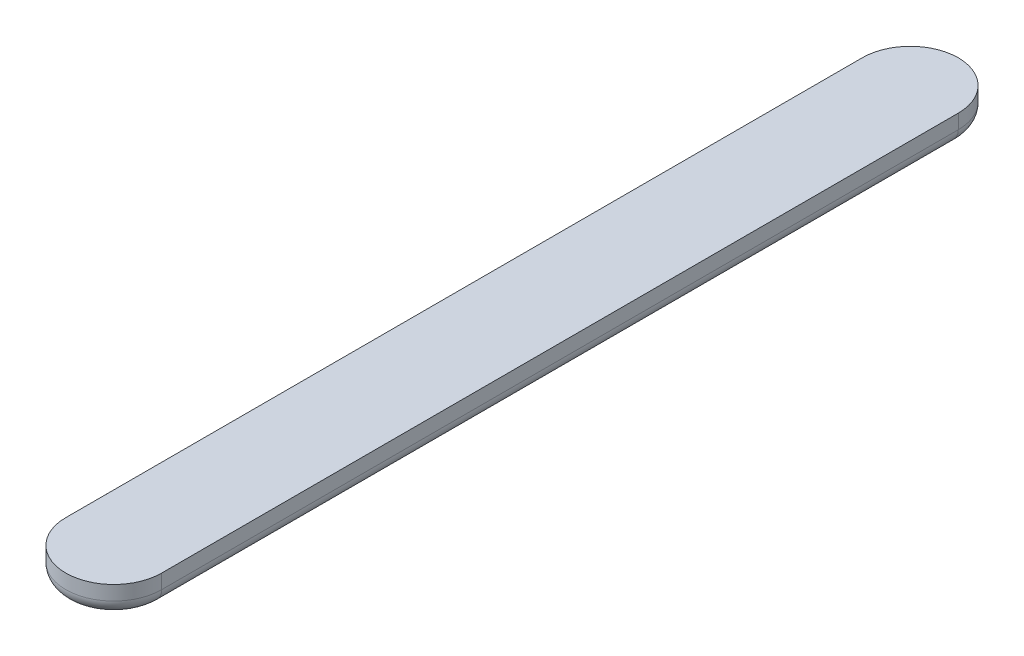
ISO-10303-21;
HEADER;
FILE_DESCRIPTION(('STEP AP214'),'2;1');
FILE_NAME('part.step','',(''),(''),'','','');
FILE_SCHEMA(('AUTOMOTIVE_DESIGN { 1 0 10303 214 1 1 1 1 }'));
ENDSEC;
DATA;
#1=APPLICATION_CONTEXT('core data for automotive mechanical design processes');
#2=APPLICATION_PROTOCOL_DEFINITION('international standard','automotive_design',2000,#1);
#3=PRODUCT_CONTEXT('',#1,'mechanical');
#4=PRODUCT('Part','Part','',(#3));
#5=PRODUCT_RELATED_PRODUCT_CATEGORY('part','',(#4));
#6=PRODUCT_DEFINITION_FORMATION('','',#4);
#7=PRODUCT_DEFINITION_CONTEXT('part definition',#1,'design');
#8=PRODUCT_DEFINITION('design','',#6,#7);
#9=PRODUCT_DEFINITION_SHAPE('','',#8);
#10=(LENGTH_UNIT() NAMED_UNIT(*) SI_UNIT(.MILLI.,.METRE.));
#11=(NAMED_UNIT(*) PLANE_ANGLE_UNIT() SI_UNIT($,.RADIAN.));
#12=(NAMED_UNIT(*) SI_UNIT($,.STERADIAN.) SOLID_ANGLE_UNIT());
#13=UNCERTAINTY_MEASURE_WITH_UNIT(LENGTH_MEASURE(1.E-05),#10,'distance_accuracy_value','');
#14=(GEOMETRIC_REPRESENTATION_CONTEXT(3) GLOBAL_UNCERTAINTY_ASSIGNED_CONTEXT((#13)) GLOBAL_UNIT_ASSIGNED_CONTEXT((#10,
#11,#12)) REPRESENTATION_CONTEXT('',''));
#15=CARTESIAN_POINT('',(0.,0.,0.));
#16=DIRECTION('',(0.,0.,1.));
#17=DIRECTION('',(1.,0.,0.));
#18=AXIS2_PLACEMENT_3D('',#15,#16,#17);
#19=CARTESIAN_POINT('',(0.,-221.2577750009,-17.9620750209408));
#20=DIRECTION('',(0.,1.,0.));
#21=DIRECTION('',(-1.,0.,0.));
#22=AXIS2_PLACEMENT_3D('',#19,#20,#21);
#23=CYLINDRICAL_SURFACE('',#22,10.);
#24=DIRECTION('',(0.,1.,0.));
#25=VECTOR('',#24,1.);
#26=CARTESIAN_POINT('',(-10.,-221.2577750009,-17.9620750209408));
#27=LINE('',#26,#25);
#28=CARTESIAN_POINT('',(-9.99999999999998,-31.1458256229943,-17.9620750209408));
#29=VERTEX_POINT('',#28);
#30=CARTESIAN_POINT('',(-9.99999999999998,-28.1458256229943,-17.9620750209408));
#31=VERTEX_POINT('',#30);
#32=EDGE_CURVE('E11',#29,#31,#27,.T.);
#33=ORIENTED_EDGE('',*,*,#32,.F.);
#34=CARTESIAN_POINT('',(0.,-31.1458256229943,-17.9620750209408));
#35=DIRECTION('',(0.,1.,0.));
#36=DIRECTION('',(1.,0.,0.));
#37=AXIS2_PLACEMENT_3D('',#34,#35,#36);
#38=CIRCLE('',#37,10.);
#39=CARTESIAN_POINT('',(10.,-31.1458256229943,-17.9620750209408));
#40=VERTEX_POINT('',#39);
#41=EDGE_CURVE('E94',#40,#29,#38,.F.);
#42=ORIENTED_EDGE('',*,*,#41,.F.);
#43=DIRECTION('',(0.,1.,0.));
#44=VECTOR('',#43,1.);
#45=CARTESIAN_POINT('',(9.99999999999999,-221.2577750009,-17.9620750209408));
#46=LINE('',#45,#44);
#47=CARTESIAN_POINT('',(10.,-28.1458256229943,-17.9620750209408));
#48=VERTEX_POINT('',#47);
#49=EDGE_CURVE('E37',#40,#48,#46,.T.);
#50=ORIENTED_EDGE('',*,*,#49,.T.);
#51=CARTESIAN_POINT('',(0.,-28.1458256229943,-17.9620750209408));
#52=DIRECTION('',(0.,1.,0.));
#53=DIRECTION('',(-1.,0.,0.));
#54=AXIS2_PLACEMENT_3D('',#51,#52,#53);
#55=CIRCLE('',#54,10.);
#56=EDGE_CURVE('E119',#31,#48,#55,.T.);
#57=ORIENTED_EDGE('',*,*,#56,.F.);
#58=EDGE_LOOP('',(#33,#42,#50,#57));
#59=FACE_BOUND('',#58,.T.);
#60=ADVANCED_FACE('F34',(#59),#23,.T.);
#61=CARTESIAN_POINT('',(-10.,-221.2577750009,-184.002075020941));
#62=DIRECTION('',(-1.,0.,0.));
#63=DIRECTION('',(0.,0.,1.));
#64=AXIS2_PLACEMENT_3D('',#61,#62,#63);
#65=PLANE('',#64);
#66=DIRECTION('',(0.,1.,0.));
#67=VECTOR('',#66,1.);
#68=CARTESIAN_POINT('',(-10.,-221.2577750009,-184.002075020941));
#69=LINE('',#68,#67);
#70=CARTESIAN_POINT('',(-10.,-31.1458256229943,-184.002075020941));
#71=VERTEX_POINT('',#70);
#72=CARTESIAN_POINT('',(-10.,-28.1458256229943,-184.002075020941));
#73=VERTEX_POINT('',#72);
#74=EDGE_CURVE('E42',#71,#73,#69,.T.);
#75=ORIENTED_EDGE('',*,*,#74,.F.);
#76=DIRECTION('',(0.,0.,1.));
#77=VECTOR('',#76,1.);
#78=CARTESIAN_POINT('',(-10.,-31.1458256229943,-184.002075020941));
#79=LINE('',#78,#77);
#80=EDGE_CURVE('E102',#29,#71,#79,.F.);
#81=ORIENTED_EDGE('',*,*,#80,.F.);
#82=ORIENTED_EDGE('',*,*,#32,.T.);
#83=DIRECTION('',(0.,0.,1.));
#84=VECTOR('',#83,1.);
#85=CARTESIAN_POINT('',(-10.,-28.1458256229943,-184.002075020941));
#86=LINE('',#85,#84);
#87=EDGE_CURVE('E131',#73,#31,#86,.T.);
#88=ORIENTED_EDGE('',*,*,#87,.F.);
#89=EDGE_LOOP('',(#75,#81,#82,#88));
#90=FACE_BOUND('',#89,.T.);
#91=ADVANCED_FACE('F150',(#90),#65,.T.);
#92=CARTESIAN_POINT('',(0.,-221.2577750009,-184.002075020941));
#93=DIRECTION('',(0.,1.,0.));
#94=DIRECTION('',(-1.,0.,0.));
#95=AXIS2_PLACEMENT_3D('',#92,#93,#94);
#96=CYLINDRICAL_SURFACE('',#95,10.);
#97=DIRECTION('',(0.,1.,0.));
#98=VECTOR('',#97,1.);
#99=CARTESIAN_POINT('',(9.99999999999997,-221.2577750009,-184.002075020941));
#100=LINE('',#99,#98);
#101=CARTESIAN_POINT('',(9.99999999999999,-31.1458256229943,-184.002075020941));
#102=VERTEX_POINT('',#101);
#103=CARTESIAN_POINT('',(9.99999999999999,-28.1458256229943,-184.002075020941));
#104=VERTEX_POINT('',#103);
#105=EDGE_CURVE('E134',#102,#104,#100,.T.);
#106=ORIENTED_EDGE('',*,*,#105,.F.);
#107=CARTESIAN_POINT('',(0.,-31.1458256229943,-184.002075020941));
#108=DIRECTION('',(0.,1.,0.));
#109=DIRECTION('',(1.,0.,0.));
#110=AXIS2_PLACEMENT_3D('',#107,#108,#109);
#111=CIRCLE('',#110,10.);
#112=EDGE_CURVE('E115',#71,#102,#111,.F.);
#113=ORIENTED_EDGE('',*,*,#112,.F.);
#114=ORIENTED_EDGE('',*,*,#74,.T.);
#115=CARTESIAN_POINT('',(0.,-28.1458256229943,-184.002075020941));
#116=DIRECTION('',(0.,1.,0.));
#117=DIRECTION('',(-1.,0.,0.));
#118=AXIS2_PLACEMENT_3D('',#115,#116,#117);
#119=CIRCLE('',#118,10.);
#120=EDGE_CURVE('E128',#104,#73,#119,.T.);
#121=ORIENTED_EDGE('',*,*,#120,.F.);
#122=EDGE_LOOP('',(#106,#113,#114,#121));
#123=FACE_BOUND('',#122,.T.);
#124=ADVANCED_FACE('F153',(#123),#96,.T.);
#125=CARTESIAN_POINT('',(9.99999999999999,-221.2577750009,-17.9620750209408));
#126=DIRECTION('',(1.,0.,0.));
#127=DIRECTION('',(0.,0.,-1.));
#128=AXIS2_PLACEMENT_3D('',#125,#126,#127);
#129=PLANE('',#128);
#130=ORIENTED_EDGE('',*,*,#49,.F.);
#131=DIRECTION('',(0.,0.,-1.));
#132=VECTOR('',#131,1.);
#133=CARTESIAN_POINT('',(10.,-31.1458256229943,-184.002075020941));
#134=LINE('',#133,#132);
#135=EDGE_CURVE('E117',#102,#40,#134,.F.);
#136=ORIENTED_EDGE('',*,*,#135,.F.);
#137=ORIENTED_EDGE('',*,*,#105,.T.);
#138=DIRECTION('',(0.,0.,-1.));
#139=VECTOR('',#138,1.);
#140=CARTESIAN_POINT('',(10.,-28.1458256229943,-17.9620750209408));
#141=LINE('',#140,#139);
#142=EDGE_CURVE('E125',#48,#104,#141,.T.);
#143=ORIENTED_EDGE('',*,*,#142,.F.);
#144=EDGE_LOOP('',(#130,#136,#137,#143));
#145=FACE_BOUND('',#144,.T.);
#146=ADVANCED_FACE('F144',(#145),#129,.T.);
#147=CARTESIAN_POINT('',(0.,-28.1458256229943,-17.9620750209408));
#148=DIRECTION('',(0.,1.,0.));
#149=DIRECTION('',(-1.,0.,0.));
#150=AXIS2_PLACEMENT_3D('',#147,#148,#149);
#151=PLANE('',#150);
#152=ORIENTED_EDGE('',*,*,#56,.T.);
#153=ORIENTED_EDGE('',*,*,#142,.T.);
#154=ORIENTED_EDGE('',*,*,#120,.T.);
#155=ORIENTED_EDGE('',*,*,#87,.T.);
#156=EDGE_LOOP('',(#152,#153,#154,#155));
#157=FACE_BOUND('',#156,.T.);
#158=ADVANCED_FACE('F146',(#157),#151,.T.);
#159=CARTESIAN_POINT('',(7.,-31.1458256229943,-184.002075020941));
#160=DIRECTION('',(0.,0.,-1.));
#161=DIRECTION('',(-1.,0.,0.));
#162=AXIS2_PLACEMENT_3D('',#159,#160,#161);
#163=CYLINDRICAL_SURFACE('',#162,3.);
#164=CARTESIAN_POINT('',(7.00000000000002,-31.1458256229943,-17.9620750209408));
#165=DIRECTION('',(0.,0.,-1.));
#166=DIRECTION('',(0.,1.,0.));
#167=AXIS2_PLACEMENT_3D('',#164,#165,#166);
#168=CIRCLE('',#167,3.);
#169=CARTESIAN_POINT('',(7.00000000000002,-34.1458256229943,-17.9620750209408));
#170=VERTEX_POINT('',#169);
#171=EDGE_CURVE('E110',#40,#170,#168,.T.);
#172=ORIENTED_EDGE('',*,*,#171,.T.);
#173=DIRECTION('',(0.,0.,-1.));
#174=VECTOR('',#173,1.);
#175=CARTESIAN_POINT('',(7.,-34.1458256229943,-184.002075020941));
#176=LINE('',#175,#174);
#177=CARTESIAN_POINT('',(7.,-34.1458256229943,-184.002075020941));
#178=VERTEX_POINT('',#177);
#179=EDGE_CURVE('E107',#170,#178,#176,.T.);
#180=ORIENTED_EDGE('',*,*,#179,.T.);
#181=CARTESIAN_POINT('',(7.,-31.1458256229943,-184.002075020941));
#182=DIRECTION('',(0.,0.,1.));
#183=DIRECTION('',(0.,-1.,0.));
#184=AXIS2_PLACEMENT_3D('',#181,#182,#183);
#185=CIRCLE('',#184,3.);
#186=EDGE_CURVE('E50',#178,#102,#185,.T.);
#187=ORIENTED_EDGE('',*,*,#186,.T.);
#188=ORIENTED_EDGE('',*,*,#135,.T.);
#189=EDGE_LOOP('',(#172,#180,#187,#188));
#190=FACE_BOUND('',#189,.T.);
#191=ADVANCED_FACE('F156',(#190),#163,.T.);
#192=CARTESIAN_POINT('',(0.,-31.1458256229943,-184.002075020941));
#193=DIRECTION('',(0.,1.,0.));
#194=DIRECTION('',(1.,0.,0.));
#195=AXIS2_PLACEMENT_3D('',#192,#193,#194);
#196=TOROIDAL_SURFACE('',#195,7.,3.);
#197=ORIENTED_EDGE('',*,*,#186,.F.);
#198=CARTESIAN_POINT('',(0.,-34.1458256229943,-184.002075020941));
#199=DIRECTION('',(0.,1.,0.));
#200=DIRECTION('',(1.,0.,0.));
#201=AXIS2_PLACEMENT_3D('',#198,#199,#200);
#202=CIRCLE('',#201,7.);
#203=CARTESIAN_POINT('',(-7.,-34.1458256229943,-184.002075020941));
#204=VERTEX_POINT('',#203);
#205=EDGE_CURVE('E103',#178,#204,#202,.T.);
#206=ORIENTED_EDGE('',*,*,#205,.T.);
#207=CARTESIAN_POINT('',(-7.,-31.1458256229943,-184.002075020941));
#208=DIRECTION('',(0.,0.,-1.));
#209=DIRECTION('',(0.,1.,0.));
#210=AXIS2_PLACEMENT_3D('',#207,#208,#209);
#211=CIRCLE('',#210,3.);
#212=EDGE_CURVE('E58',#204,#71,#211,.T.);
#213=ORIENTED_EDGE('',*,*,#212,.T.);
#214=ORIENTED_EDGE('',*,*,#112,.T.);
#215=EDGE_LOOP('',(#197,#206,#213,#214));
#216=FACE_BOUND('',#215,.T.);
#217=ADVANCED_FACE('F155',(#216),#196,.T.);
#218=CARTESIAN_POINT('',(0.,-31.1458256229943,-17.9620750209408));
#219=DIRECTION('',(0.,1.,0.));
#220=DIRECTION('',(1.,0.,0.));
#221=AXIS2_PLACEMENT_3D('',#218,#219,#220);
#222=TOROIDAL_SURFACE('',#221,7.,3.);
#223=ORIENTED_EDGE('',*,*,#171,.F.);
#224=ORIENTED_EDGE('',*,*,#41,.T.);
#225=CARTESIAN_POINT('',(-6.99999999999998,-31.1458256229943,-17.9620750209408));
#226=DIRECTION('',(0.,0.,1.));
#227=DIRECTION('',(0.,-1.,0.));
#228=AXIS2_PLACEMENT_3D('',#225,#226,#227);
#229=CIRCLE('',#228,3.);
#230=CARTESIAN_POINT('',(-6.99999999999998,-34.1458256229943,-17.9620750209408));
#231=VERTEX_POINT('',#230);
#232=EDGE_CURVE('E87',#29,#231,#229,.T.);
#233=ORIENTED_EDGE('',*,*,#232,.T.);
#234=CARTESIAN_POINT('',(0.,-34.1458256229943,-17.9620750209408));
#235=DIRECTION('',(0.,1.,0.));
#236=DIRECTION('',(1.,0.,0.));
#237=AXIS2_PLACEMENT_3D('',#234,#235,#236);
#238=CIRCLE('',#237,7.);
#239=EDGE_CURVE('E91',#231,#170,#238,.T.);
#240=ORIENTED_EDGE('',*,*,#239,.T.);
#241=EDGE_LOOP('',(#223,#224,#233,#240));
#242=FACE_BOUND('',#241,.T.);
#243=ADVANCED_FACE('F89',(#242),#222,.T.);
#244=CARTESIAN_POINT('',(-7.,-31.1458256229943,-184.002075020941));
#245=DIRECTION('',(0.,0.,1.));
#246=DIRECTION('',(1.,0.,0.));
#247=AXIS2_PLACEMENT_3D('',#244,#245,#246);
#248=CYLINDRICAL_SURFACE('',#247,3.);
#249=ORIENTED_EDGE('',*,*,#212,.F.);
#250=DIRECTION('',(0.,0.,1.));
#251=VECTOR('',#250,1.);
#252=CARTESIAN_POINT('',(-7.,-34.1458256229943,-184.002075020941));
#253=LINE('',#252,#251);
#254=EDGE_CURVE('E98',#204,#231,#253,.T.);
#255=ORIENTED_EDGE('',*,*,#254,.T.);
#256=ORIENTED_EDGE('',*,*,#232,.F.);
#257=ORIENTED_EDGE('',*,*,#80,.T.);
#258=EDGE_LOOP('',(#249,#255,#256,#257));
#259=FACE_BOUND('',#258,.T.);
#260=ADVANCED_FACE('F99',(#259),#248,.T.);
#261=CARTESIAN_POINT('',(0.,-34.1458256229943,-184.002075020941));
#262=DIRECTION('',(0.,1.,0.));
#263=DIRECTION('',(1.,0.,0.));
#264=AXIS2_PLACEMENT_3D('',#261,#262,#263);
#265=PLANE('',#264);
#266=ORIENTED_EDGE('',*,*,#179,.F.);
#267=ORIENTED_EDGE('',*,*,#239,.F.);
#268=ORIENTED_EDGE('',*,*,#254,.F.);
#269=ORIENTED_EDGE('',*,*,#205,.F.);
#270=EDGE_LOOP('',(#266,#267,#268,#269));
#271=FACE_BOUND('',#270,.T.);
#272=ADVANCED_FACE('F106',(#271),#265,.F.);
#273=CLOSED_SHELL('',(#60,#91,#124,#146,#158,#191,#217,#243,#260,#272));
#274=MANIFOLD_SOLID_BREP('B2',#273);
#275=ADVANCED_BREP_SHAPE_REPRESENTATION('',(#18,#274),#14);
#276=SHAPE_DEFINITION_REPRESENTATION(#9,#275);
ENDSEC;
END-ISO-10303-21;
